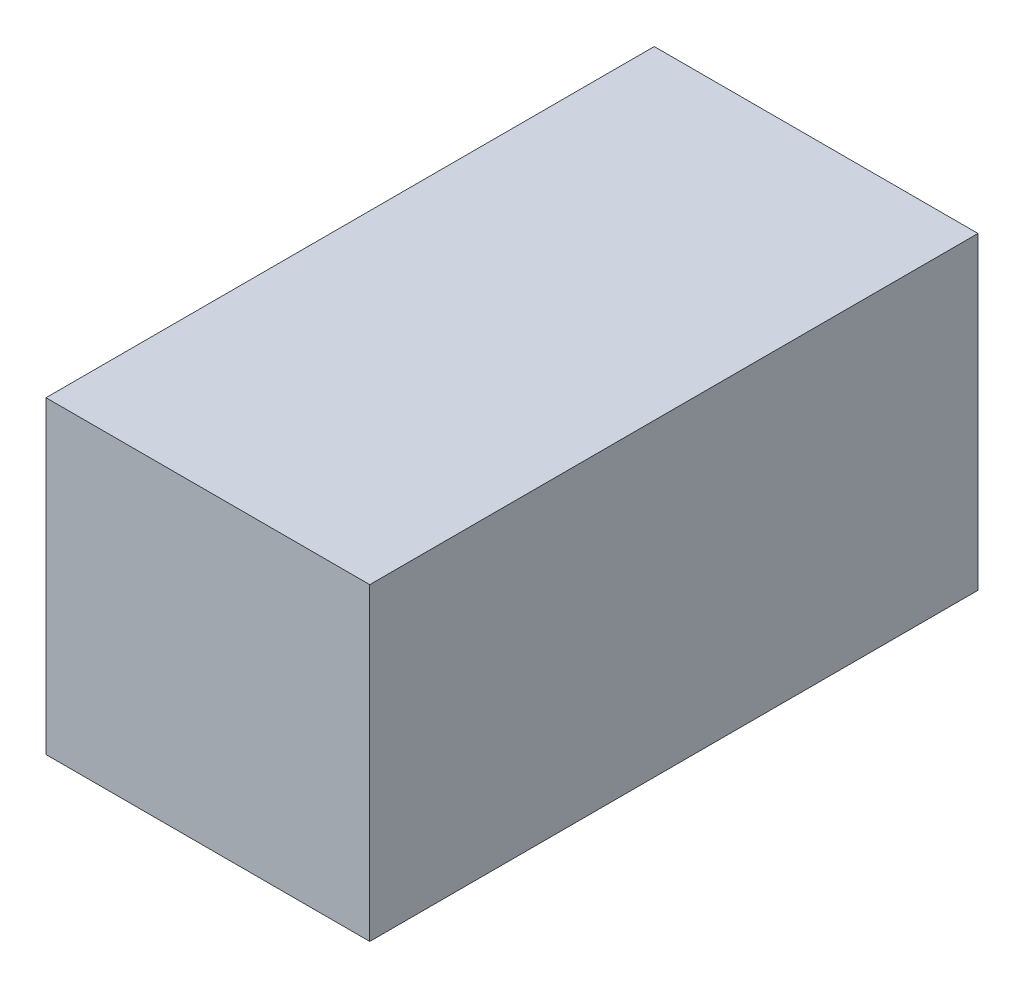
ISO-10303-21;
HEADER;
FILE_DESCRIPTION(('STEP AP214'),'2;1');
FILE_NAME('part.step','',(''),(''),'','','');
FILE_SCHEMA(('AUTOMOTIVE_DESIGN { 1 0 10303 214 1 1 1 1 }'));
ENDSEC;
DATA;
#1=APPLICATION_CONTEXT('core data for automotive mechanical design processes');
#2=APPLICATION_PROTOCOL_DEFINITION('international standard','automotive_design',2000,#1);
#3=PRODUCT_CONTEXT('',#1,'mechanical');
#4=PRODUCT('Part','Part','',(#3));
#5=PRODUCT_RELATED_PRODUCT_CATEGORY('part','',(#4));
#6=PRODUCT_DEFINITION_FORMATION('','',#4);
#7=PRODUCT_DEFINITION_CONTEXT('part definition',#1,'design');
#8=PRODUCT_DEFINITION('design','',#6,#7);
#9=PRODUCT_DEFINITION_SHAPE('','',#8);
#10=(LENGTH_UNIT() NAMED_UNIT(*) SI_UNIT(.MILLI.,.METRE.));
#11=(NAMED_UNIT(*) PLANE_ANGLE_UNIT() SI_UNIT($,.RADIAN.));
#12=(NAMED_UNIT(*) SI_UNIT($,.STERADIAN.) SOLID_ANGLE_UNIT());
#13=UNCERTAINTY_MEASURE_WITH_UNIT(LENGTH_MEASURE(1.E-05),#10,'distance_accuracy_value','');
#14=(GEOMETRIC_REPRESENTATION_CONTEXT(3) GLOBAL_UNCERTAINTY_ASSIGNED_CONTEXT((#13)) GLOBAL_UNIT_ASSIGNED_CONTEXT((#10,
#11,#12)) REPRESENTATION_CONTEXT('',''));
#15=CARTESIAN_POINT('',(0.,0.,0.));
#16=DIRECTION('',(0.,0.,1.));
#17=DIRECTION('',(1.,0.,0.));
#18=AXIS2_PLACEMENT_3D('',#15,#16,#17);
#19=CARTESIAN_POINT('',(-19209.8350573435,-7112.93515040095,40231.7001960568));
#20=DIRECTION('',(1.,0.,0.));
#21=DIRECTION('',(0.,0.,-1.));
#22=AXIS2_PLACEMENT_3D('',#19,#20,#21);
#23=PLANE('',#22);
#24=DIRECTION('',(0.,-1.,0.));
#25=VECTOR('',#24,1.);
#26=CARTESIAN_POINT('',(-19209.8350573435,-7112.93515040095,38991.7001960568));
#27=LINE('',#26,#25);
#28=CARTESIAN_POINT('',(-19209.8350573435,-7112.93515040095,38991.7001960568));
#29=VERTEX_POINT('',#28);
#30=CARTESIAN_POINT('',(-19209.8350573435,-7742.93515040095,38991.7001960568));
#31=VERTEX_POINT('',#30);
#32=EDGE_CURVE('E100',#29,#31,#27,.T.);
#33=ORIENTED_EDGE('',*,*,#32,.T.);
#34=DIRECTION('',(0.,0.,-1.));
#35=VECTOR('',#34,1.);
#36=CARTESIAN_POINT('',(-19209.8350573435,-7742.93515040095,40231.7001960568));
#37=LINE('',#36,#35);
#38=CARTESIAN_POINT('',(-19209.8350573435,-7742.93515040095,40231.7001960568));
#39=VERTEX_POINT('',#38);
#40=EDGE_CURVE('E11',#39,#31,#37,.T.);
#41=ORIENTED_EDGE('',*,*,#40,.F.);
#42=DIRECTION('',(0.,-1.,0.));
#43=VECTOR('',#42,1.);
#44=CARTESIAN_POINT('',(-19209.8350573435,-7112.93515040095,40231.7001960568));
#45=LINE('',#44,#43);
#46=CARTESIAN_POINT('',(-19209.8350573435,-7112.93515040095,40231.7001960568));
#47=VERTEX_POINT('',#46);
#48=EDGE_CURVE('E88',#47,#39,#45,.T.);
#49=ORIENTED_EDGE('',*,*,#48,.F.);
#50=DIRECTION('',(0.,0.,-1.));
#51=VECTOR('',#50,1.);
#52=CARTESIAN_POINT('',(-19209.8350573435,-7112.93515040095,40231.7001960568));
#53=LINE('',#52,#51);
#54=EDGE_CURVE('E96',#47,#29,#53,.T.);
#55=ORIENTED_EDGE('',*,*,#54,.T.);
#56=EDGE_LOOP('',(#33,#41,#49,#55));
#57=FACE_BOUND('',#56,.T.);
#58=ADVANCED_FACE('F37',(#57),#23,.F.);
#59=CARTESIAN_POINT('',(-19209.8350573435,-7742.93515040095,40231.7001960568));
#60=DIRECTION('',(0.,1.,0.));
#61=DIRECTION('',(-1.,0.,0.));
#62=AXIS2_PLACEMENT_3D('',#59,#60,#61);
#63=PLANE('',#62);
#64=DIRECTION('',(1.,0.,0.));
#65=VECTOR('',#64,1.);
#66=CARTESIAN_POINT('',(-19209.8350573435,-7742.93515040095,38991.7001960568));
#67=LINE('',#66,#65);
#68=CARTESIAN_POINT('',(-18549.8350573435,-7742.93515040095,38991.7001960568));
#69=VERTEX_POINT('',#68);
#70=EDGE_CURVE('E92',#31,#69,#67,.T.);
#71=ORIENTED_EDGE('',*,*,#70,.T.);
#72=DIRECTION('',(0.,0.,-1.));
#73=VECTOR('',#72,1.);
#74=CARTESIAN_POINT('',(-18549.8350573435,-7742.93515040095,40231.7001960568));
#75=LINE('',#74,#73);
#76=CARTESIAN_POINT('',(-18549.8350573435,-7742.93515040095,40231.7001960568));
#77=VERTEX_POINT('',#76);
#78=EDGE_CURVE('E45',#77,#69,#75,.T.);
#79=ORIENTED_EDGE('',*,*,#78,.F.);
#80=DIRECTION('',(1.,0.,0.));
#81=VECTOR('',#80,1.);
#82=CARTESIAN_POINT('',(-19209.8350573435,-7742.93515040095,40231.7001960568));
#83=LINE('',#82,#81);
#84=EDGE_CURVE('E83',#39,#77,#83,.T.);
#85=ORIENTED_EDGE('',*,*,#84,.F.);
#86=ORIENTED_EDGE('',*,*,#40,.T.);
#87=EDGE_LOOP('',(#71,#79,#85,#86));
#88=FACE_BOUND('',#87,.T.);
#89=ADVANCED_FACE('F91',(#88),#63,.F.);
#90=CARTESIAN_POINT('',(-18549.8350573435,-7112.93515040095,40231.7001960568));
#91=DIRECTION('',(-1.,0.,0.));
#92=DIRECTION('',(0.,0.,1.));
#93=AXIS2_PLACEMENT_3D('',#90,#91,#92);
#94=PLANE('',#93);
#95=DIRECTION('',(0.,1.,0.));
#96=VECTOR('',#95,1.);
#97=CARTESIAN_POINT('',(-18549.8350573435,-7112.93515040095,38991.7001960568));
#98=LINE('',#97,#96);
#99=CARTESIAN_POINT('',(-18549.8350573435,-7112.93515040095,38991.7001960568));
#100=VERTEX_POINT('',#99);
#101=EDGE_CURVE('E70',#69,#100,#98,.T.);
#102=ORIENTED_EDGE('',*,*,#101,.T.);
#103=DIRECTION('',(0.,0.,-1.));
#104=VECTOR('',#103,1.);
#105=CARTESIAN_POINT('',(-18549.8350573435,-7112.93515040095,40231.7001960568));
#106=LINE('',#105,#104);
#107=CARTESIAN_POINT('',(-18549.8350573435,-7112.93515040095,40231.7001960568));
#108=VERTEX_POINT('',#107);
#109=EDGE_CURVE('E93',#108,#100,#106,.T.);
#110=ORIENTED_EDGE('',*,*,#109,.F.);
#111=DIRECTION('',(0.,1.,0.));
#112=VECTOR('',#111,1.);
#113=CARTESIAN_POINT('',(-18549.8350573435,-7112.93515040095,40231.7001960568));
#114=LINE('',#113,#112);
#115=EDGE_CURVE('E86',#77,#108,#114,.T.);
#116=ORIENTED_EDGE('',*,*,#115,.F.);
#117=ORIENTED_EDGE('',*,*,#78,.T.);
#118=EDGE_LOOP('',(#102,#110,#116,#117));
#119=FACE_BOUND('',#118,.T.);
#120=ADVANCED_FACE('F94',(#119),#94,.F.);
#121=CARTESIAN_POINT('',(-19209.8350573435,-7112.93515040095,40231.7001960568));
#122=DIRECTION('',(0.,-1.,0.));
#123=DIRECTION('',(0.,0.,-1.));
#124=AXIS2_PLACEMENT_3D('',#121,#122,#123);
#125=PLANE('',#124);
#126=DIRECTION('',(-1.,0.,0.));
#127=VECTOR('',#126,1.);
#128=CARTESIAN_POINT('',(-19209.8350573435,-7112.93515040095,38991.7001960568));
#129=LINE('',#128,#127);
#130=EDGE_CURVE('E76',#100,#29,#129,.T.);
#131=ORIENTED_EDGE('',*,*,#130,.T.);
#132=ORIENTED_EDGE('',*,*,#54,.F.);
#133=DIRECTION('',(-1.,0.,0.));
#134=VECTOR('',#133,1.);
#135=CARTESIAN_POINT('',(-19209.8350573435,-7112.93515040095,40231.7001960568));
#136=LINE('',#135,#134);
#137=EDGE_CURVE('E53',#108,#47,#136,.T.);
#138=ORIENTED_EDGE('',*,*,#137,.F.);
#139=ORIENTED_EDGE('',*,*,#109,.T.);
#140=EDGE_LOOP('',(#131,#132,#138,#139));
#141=FACE_BOUND('',#140,.T.);
#142=ADVANCED_FACE('F107',(#141),#125,.F.);
#143=CARTESIAN_POINT('',(0.,0.,40231.7001960568));
#144=DIRECTION('',(0.,0.,1.));
#145=DIRECTION('',(1.,0.,0.));
#146=AXIS2_PLACEMENT_3D('',#143,#144,#145);
#147=PLANE('',#146);
#148=ORIENTED_EDGE('',*,*,#48,.T.);
#149=ORIENTED_EDGE('',*,*,#84,.T.);
#150=ORIENTED_EDGE('',*,*,#115,.T.);
#151=ORIENTED_EDGE('',*,*,#137,.T.);
#152=EDGE_LOOP('',(#148,#149,#150,#151));
#153=FACE_BOUND('',#152,.T.);
#154=ADVANCED_FACE('F84',(#153),#147,.T.);
#155=CARTESIAN_POINT('',(0.,0.,38991.7001960568));
#156=DIRECTION('',(0.,0.,1.));
#157=DIRECTION('',(1.,0.,0.));
#158=AXIS2_PLACEMENT_3D('',#155,#156,#157);
#159=PLANE('',#158);
#160=ORIENTED_EDGE('',*,*,#32,.F.);
#161=ORIENTED_EDGE('',*,*,#130,.F.);
#162=ORIENTED_EDGE('',*,*,#101,.F.);
#163=ORIENTED_EDGE('',*,*,#70,.F.);
#164=EDGE_LOOP('',(#160,#161,#162,#163));
#165=FACE_BOUND('',#164,.T.);
#166=ADVANCED_FACE('F110',(#165),#159,.F.);
#167=CLOSED_SHELL('',(#58,#89,#120,#142,#154,#166));
#168=MANIFOLD_SOLID_BREP('B2',#167);
#169=ADVANCED_BREP_SHAPE_REPRESENTATION('',(#18,#168),#14);
#170=SHAPE_DEFINITION_REPRESENTATION(#9,#169);
ENDSEC;
END-ISO-10303-21;
